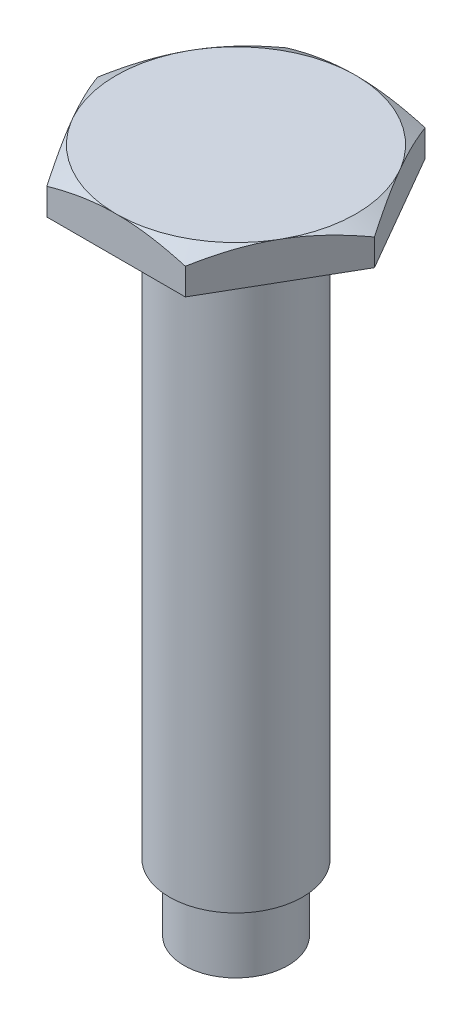
ISO-10303-21;
HEADER;
FILE_DESCRIPTION(('STEP AP214'),'2;1');
FILE_NAME('part.step','',(''),(''),'','','');
FILE_SCHEMA(('AUTOMOTIVE_DESIGN { 1 0 10303 214 1 1 1 1 }'));
ENDSEC;
DATA;
#1=APPLICATION_CONTEXT('core data for automotive mechanical design processes');
#2=APPLICATION_PROTOCOL_DEFINITION('international standard','automotive_design',2000,#1);
#3=PRODUCT_CONTEXT('',#1,'mechanical');
#4=PRODUCT('Part','Part','',(#3));
#5=PRODUCT_RELATED_PRODUCT_CATEGORY('part','',(#4));
#6=PRODUCT_DEFINITION_FORMATION('','',#4);
#7=PRODUCT_DEFINITION_CONTEXT('part definition',#1,'design');
#8=PRODUCT_DEFINITION('design','',#6,#7);
#9=PRODUCT_DEFINITION_SHAPE('','',#8);
#10=(LENGTH_UNIT() NAMED_UNIT(*) SI_UNIT(.MILLI.,.METRE.));
#11=(NAMED_UNIT(*) PLANE_ANGLE_UNIT() SI_UNIT($,.RADIAN.));
#12=(NAMED_UNIT(*) SI_UNIT($,.STERADIAN.) SOLID_ANGLE_UNIT());
#13=UNCERTAINTY_MEASURE_WITH_UNIT(LENGTH_MEASURE(1.E-05),#10,'distance_accuracy_value','');
#14=(GEOMETRIC_REPRESENTATION_CONTEXT(3) GLOBAL_UNCERTAINTY_ASSIGNED_CONTEXT((#13)) GLOBAL_UNIT_ASSIGNED_CONTEXT((#10,
#11,#12)) REPRESENTATION_CONTEXT('',''));
#15=CARTESIAN_POINT('',(0.,0.,0.));
#16=DIRECTION('',(0.,0.,1.));
#17=DIRECTION('',(1.,0.,0.));
#18=AXIS2_PLACEMENT_3D('',#15,#16,#17);
#19=CARTESIAN_POINT('',(0.,-24.3,0.));
#20=DIRECTION('',(0.,1.,0.));
#21=DIRECTION('',(0.,0.,1.));
#22=AXIS2_PLACEMENT_3D('',#19,#20,#21);
#23=CYLINDRICAL_SURFACE('',#22,2.5);
#24=CARTESIAN_POINT('',(0.,0.,0.));
#25=DIRECTION('',(0.,1.,0.));
#26=DIRECTION('',(0.,0.,1.));
#27=AXIS2_PLACEMENT_3D('',#24,#25,#26);
#28=CIRCLE('',#27,2.5);
#29=CARTESIAN_POINT('',(0.,0.,2.5));
#30=VERTEX_POINT('',#29);
#31=EDGE_CURVE('E13',#30,#30,#28,.F.);
#32=ORIENTED_EDGE('',*,*,#31,.T.);
#33=EDGE_LOOP('',(#32));
#34=FACE_BOUND('',#33,.T.);
#35=CARTESIAN_POINT('',(0.,-21.8,0.));
#36=DIRECTION('',(0.,-1.,0.));
#37=DIRECTION('',(0.,0.,-1.));
#38=AXIS2_PLACEMENT_3D('',#35,#36,#37);
#39=CIRCLE('',#38,2.5);
#40=CARTESIAN_POINT('',(0.,-21.8,-2.5));
#41=VERTEX_POINT('',#40);
#42=EDGE_CURVE('E60',#41,#41,#39,.T.);
#43=ORIENTED_EDGE('',*,*,#42,.F.);
#44=EDGE_LOOP('',(#43));
#45=FACE_BOUND('',#44,.T.);
#46=ADVANCED_FACE('F55',(#34,#45),#23,.T.);
#47=CARTESIAN_POINT('',(2.5975,1.4,4.49900197266016));
#48=DIRECTION('',(-0.866025403784439,0.,-0.5));
#49=DIRECTION('',(-0.5,0.,0.866025403784439));
#50=AXIS2_PLACEMENT_3D('',#47,#48,#49);
#51=PLANE('',#50);
#52=CARTESIAN_POINT('',(0.764746267767835,-0.454124789273067,7.67342455464776));
#53=CARTESIAN_POINT('',(0.846540705660757,-0.377433019190196,7.53175243244068));
#54=CARTESIAN_POINT('',(0.928528072742444,-0.301551957905063,7.3897461470764));
#55=CARTESIAN_POINT('',(1.09297003020882,-0.151791197053435,7.10492432184856));
#56=CARTESIAN_POINT('',(1.17542467594591,-0.0779117408474091,6.96210868611182));
#57=CARTESIAN_POINT('',(1.34112030157134,0.0676733695980131,6.67511544393666));
#58=CARTESIAN_POINT('',(1.42436293029547,0.139371540587462,6.53093498163088));
#59=CARTESIAN_POINT('',(1.59146398387532,0.279831230371151,6.24150746683229));
#60=CARTESIAN_POINT('',(1.67532238968743,0.348592839537418,6.09626044732398));
#61=CARTESIAN_POINT('',(1.84599265044855,0.484316646401144,5.80065088434469));
#62=CARTESIAN_POINT('',(1.93282376130974,0.551182431909523,5.65025498865547));
#63=CARTESIAN_POINT('',(2.10734549477341,0.680257160061498,5.3479744792714));
#64=CARTESIAN_POINT('',(2.19503606852409,0.742466365668551,5.19608995019036));
#65=CARTESIAN_POINT('',(2.37131571795982,0.861080845971694,4.89076464102724));
#66=CARTESIAN_POINT('',(2.45990392715668,0.917491222644587,4.73732536174674));
#67=CARTESIAN_POINT('',(2.63812027232068,1.02322633098802,4.42864559718346));
#68=CARTESIAN_POINT('',(2.72774827495578,1.07255196051071,4.27340534283854));
#69=CARTESIAN_POINT('',(2.94167693195855,1.17932065353719,3.90287003971477));
#70=CARTESIAN_POINT('',(3.06647240761128,1.23295723560288,3.68671793532951));
#71=CARTESIAN_POINT('',(3.25497393542946,1.29798014863304,3.36022371184407));
#72=CARTESIAN_POINT('',(3.31802487416995,1.31708228871089,3.25101628248064));
#73=CARTESIAN_POINT('',(3.44448603325496,1.34966788109555,3.03197912976134));
#74=CARTESIAN_POINT('',(3.50789620500962,1.36315207572337,2.92214949056561));
#75=CARTESIAN_POINT('',(3.63421230786921,1.3839969781063,2.7033635825987));
#76=CARTESIAN_POINT('',(3.69711530695999,1.39142837342597,2.59441239222501));
#77=CARTESIAN_POINT('',(3.82302741588169,1.40021353929659,2.37632622228448));
#78=CARTESIAN_POINT('',(3.88603652392881,1.40156741101706,2.26719124580728));
#79=CARTESIAN_POINT('',(4.01201417247894,1.39815550680156,2.04899155790038));
#80=CARTESIAN_POINT('',(4.07498271233779,1.39338963597678,1.93992684758643));
#81=CARTESIAN_POINT('',(4.20073678228329,1.37788386249752,1.72211440918226));
#82=CARTESIAN_POINT('',(4.26352230002154,1.36714356571949,1.6133667024801));
#83=CARTESIAN_POINT('',(4.41065120501361,1.33525044365775,1.35853196377184));
#84=CARTESIAN_POINT('',(4.49486953949365,1.31177164019821,1.2126615295236));
#85=CARTESIAN_POINT('',(4.66253101838631,1.25557216182377,0.922263329609364));
#86=CARTESIAN_POINT('',(4.74597403931673,1.22285003995282,0.777735777820844));
#87=CARTESIAN_POINT('',(4.91205251429679,1.14940005301191,0.490079421111826));
#88=CARTESIAN_POINT('',(4.99468708095955,1.10866424445279,0.346952153190496));
#89=CARTESIAN_POINT('',(5.15904334370627,1.02046987040766,0.0622787555710296));
#90=CARTESIAN_POINT('',(5.24076506447544,0.973011487190809,-0.0792674168831269));
#91=CARTESIAN_POINT('',(5.40431916872383,0.871907470927307,-0.362551435227752));
#92=CARTESIAN_POINT('',(5.48614102218207,0.818194179899497,-0.504271042586887));
#93=CARTESIAN_POINT('',(5.64897798391222,0.706057896456655,-0.786312933653649));
#94=CARTESIAN_POINT('',(5.72999301279723,0.647634445633892,-0.926635079859158));
#95=CARTESIAN_POINT('',(5.89125020454739,0.526954778850263,-1.2059407290563));
#96=CARTESIAN_POINT('',(5.97149278220745,0.464700769888742,-1.34492495049381));
#97=CARTESIAN_POINT('',(6.13134236600289,0.337008626902665,-1.62179255119626));
#98=CARTESIAN_POINT('',(6.21094935554493,0.271570410062166,-1.75967590172068));
#99=CARTESIAN_POINT('',(6.35269983057958,0.152286187773574,-2.00519492647773));
#100=CARTESIAN_POINT('',(6.41494928140599,0.0989419583375809,-2.11301413805233));
#101=CARTESIAN_POINT('',(6.53913777871832,-0.00915825365950849,-2.32811492511291));
#102=CARTESIAN_POINT('',(6.60107683757794,-0.063914179400276,-2.43539652203077));
#103=CARTESIAN_POINT('',(6.72394062975798,-0.173990162223894,-2.64820285249718));
#104=CARTESIAN_POINT('',(6.78486863438338,-0.229295639253393,-2.75373325211216));
#105=CARTESIAN_POINT('',(6.90648459300393,-0.340958275081431,-2.96437827145415));
#106=CARTESIAN_POINT('',(6.96717254297768,-0.397315451408354,-3.06949288421589));
#107=CARTESIAN_POINT('',(7.02775373223217,-0.454124789273058,-3.1744225819876));
#108=B_SPLINE_CURVE_WITH_KNOTS('',3,(#52,#53,#54,#55,#56,#57,#58,#59,#60,#61,#62,#63,#64,#65,
#66,#67,#68,#69,#70,#71,#72,#73,#74,#75,#76,#77,#78,#79,#80,#81,#82,#83,#84,#85,#86,#87,#88,#89,
#90,#91,#92,#93,#94,#95,#96,#97,#98,#99,#100,#101,#102,#103,#104,#105,#106,#107),.UNSPECIFIED.,
.F.,.F.,(4,2,2,2,2,2,2,2,2,2,2,2,2,2,2,2,2,2,2,2,2,2,2,2,2,2,2,4),(0.,0.542026372178204,
1.08411835228508,1.62789791735099,2.17166073564649,2.72987716868045,3.28806205464704,
3.84575155274402,4.40337031220445,5.16842888782534,5.550946692113,5.9334139367919,
6.31134777627519,6.68927532445917,7.06720873261637,7.44516707540755,7.95505681600911,
8.46502641941073,8.97550409574346,9.48596793414437,10.0025821226153,10.5192466504577,
11.0356162367859,11.5519992602125,11.9583277083475,12.3646398273455,12.7660923087187,
13.1675514869771),.UNSPECIFIED.);
#109=CARTESIAN_POINT('',(2.5975,0.998741562913211,4.49900197266016));
#110=VERTEX_POINT('',#109);
#111=CARTESIAN_POINT('',(3.84886527144745,1.4,2.33157374368596));
#112=VERTEX_POINT('',#111);
#113=EDGE_CURVE('E151',#110,#112,#108,.T.);
#114=ORIENTED_EDGE('',*,*,#113,.F.);
#115=DIRECTION('',(0.,-1.,0.));
#116=VECTOR('',#115,1.);
#117=CARTESIAN_POINT('',(2.5975,1.4,4.49900197266016));
#118=LINE('',#117,#116);
#119=CARTESIAN_POINT('',(2.5975,0.,4.49900197266016));
#120=VERTEX_POINT('',#119);
#121=EDGE_CURVE('E164',#110,#120,#118,.T.);
#122=ORIENTED_EDGE('',*,*,#121,.T.);
#123=DIRECTION('',(0.5,0.,-0.866025403784439));
#124=VECTOR('',#123,1.);
#125=CARTESIAN_POINT('',(2.5975,0.,4.49900197266016));
#126=LINE('',#125,#124);
#127=CARTESIAN_POINT('',(5.195,0.,0.));
#128=VERTEX_POINT('',#127);
#129=EDGE_CURVE('E183',#120,#128,#126,.T.);
#130=ORIENTED_EDGE('',*,*,#129,.T.);
#131=DIRECTION('',(0.,-1.,0.));
#132=VECTOR('',#131,1.);
#133=CARTESIAN_POINT('',(5.195,1.4,0.));
#134=LINE('',#133,#132);
#135=CARTESIAN_POINT('',(5.19500000000003,0.998741562913259,0.));
#136=VERTEX_POINT('',#135);
#137=EDGE_CURVE('E218',#136,#128,#134,.T.);
#138=ORIENTED_EDGE('',*,*,#137,.F.);
#139=CARTESIAN_POINT('',(3.94363472855255,1.4,2.1674282289742));
#140=VERTEX_POINT('',#139);
#141=EDGE_CURVE('E188',#140,#136,#108,.T.);
#142=ORIENTED_EDGE('',*,*,#141,.F.);
#143=DIRECTION('',(0.5,0.,-0.866025403784439));
#144=VECTOR('',#143,1.);
#145=CARTESIAN_POINT('',(2.5975,1.4,4.49900197266016));
#146=LINE('',#145,#144);
#147=EDGE_CURVE('E205',#112,#140,#146,.T.);
#148=ORIENTED_EDGE('',*,*,#147,.F.);
#149=EDGE_LOOP('',(#114,#122,#130,#138,#142,#148));
#150=FACE_BOUND('',#149,.T.);
#151=ADVANCED_FACE('F57',(#150),#51,.F.);
#152=CARTESIAN_POINT('',(5.195,1.4,0.));
#153=DIRECTION('',(-0.866025403784439,0.,0.5));
#154=DIRECTION('',(0.5,0.,0.866025403784439));
#155=AXIS2_PLACEMENT_3D('',#152,#153,#154);
#156=PLANE('',#155);
#157=CARTESIAN_POINT('',(7.02775373223216,-0.454124789273065,3.17442258198759));
#158=CARTESIAN_POINT('',(6.94595929433924,-0.377433019190193,3.03275045978052));
#159=CARTESIAN_POINT('',(6.86397192725755,-0.30155195790506,2.89074417441623));
#160=CARTESIAN_POINT('',(6.69952996979118,-0.151791197053433,2.6059223491884));
#161=CARTESIAN_POINT('',(6.61707532405409,-0.077911740847407,2.46310671345166));
#162=CARTESIAN_POINT('',(6.45137969842866,0.0676733695980147,2.1761134712765));
#163=CARTESIAN_POINT('',(6.36813706970453,0.139371540587463,2.03193300897072));
#164=CARTESIAN_POINT('',(6.20103601612468,0.279831230371152,1.74250549417213));
#165=CARTESIAN_POINT('',(6.11717761031257,0.34859283953742,1.59725847466382));
#166=CARTESIAN_POINT('',(5.94650734955145,0.484316646401146,1.30164891168453));
#167=CARTESIAN_POINT('',(5.85967623869026,0.551182431909525,1.15125301599531));
#168=CARTESIAN_POINT('',(5.68515450522659,0.680257160061499,0.848972506611236));
#169=CARTESIAN_POINT('',(5.59746393147591,0.742466365668553,0.697087977530198));
#170=CARTESIAN_POINT('',(5.42118428204018,0.861080845971696,0.391762668367075));
#171=CARTESIAN_POINT('',(5.33259607284332,0.917491222644589,0.238323389086572));
#172=CARTESIAN_POINT('',(5.15437972767932,1.02322633098802,-0.0703563754767021));
#173=CARTESIAN_POINT('',(5.06475172504421,1.07255196051071,-0.225596629821623));
#174=CARTESIAN_POINT('',(4.85082306804145,1.17932065353719,-0.596131932945389));
#175=CARTESIAN_POINT('',(4.72602759238872,1.23295723560288,-0.812284037330647));
#176=CARTESIAN_POINT('',(4.53752606457053,1.29798014863304,-1.1387782608161));
#177=CARTESIAN_POINT('',(4.47447512583005,1.31708228871089,-1.24798569017953));
#178=CARTESIAN_POINT('',(4.34801396674504,1.34966788109555,-1.46702284289882));
#179=CARTESIAN_POINT('',(4.28460379499038,1.36315207572337,-1.57685248209455));
#180=CARTESIAN_POINT('',(4.15828769213079,1.3839969781063,-1.79563839006147));
#181=CARTESIAN_POINT('',(4.09538469304001,1.39142837342597,-1.90458958043515));
#182=CARTESIAN_POINT('',(3.96947258411831,1.40021353929659,-2.12267575037568));
#183=CARTESIAN_POINT('',(3.90646347607119,1.40156741101706,-2.23181072685288));
#184=CARTESIAN_POINT('',(3.78048582752106,1.39815550680156,-2.45001041475978));
#185=CARTESIAN_POINT('',(3.71751728766221,1.39338963597678,-2.55907512507373));
#186=CARTESIAN_POINT('',(3.59176321771671,1.37788386249752,-2.7768875634779));
#187=CARTESIAN_POINT('',(3.52897769997846,1.36714356571949,-2.88563527018006));
#188=CARTESIAN_POINT('',(3.38184879498638,1.33525044365775,-3.14047000888832));
#189=CARTESIAN_POINT('',(3.29763046050635,1.31177164019821,-3.28634044313656));
#190=CARTESIAN_POINT('',(3.12996898161369,1.25557216182377,-3.57673864305079));
#191=CARTESIAN_POINT('',(3.04652596068327,1.22285003995282,-3.72126619483932));
#192=CARTESIAN_POINT('',(2.88044748570321,1.14940005301191,-4.00892255154833));
#193=CARTESIAN_POINT('',(2.79781291904045,1.10866424445279,-4.15204981946966));
#194=CARTESIAN_POINT('',(2.63345665629373,1.02046987040766,-4.43672321708913));
#195=CARTESIAN_POINT('',(2.55173493552456,0.973011487190809,-4.57826938954329));
#196=CARTESIAN_POINT('',(2.38818083127617,0.871907470927306,-4.86155340788791));
#197=CARTESIAN_POINT('',(2.30635897781793,0.818194179899496,-5.00327301524705));
#198=CARTESIAN_POINT('',(2.14352201608778,0.706057896456654,-5.28531490631381));
#199=CARTESIAN_POINT('',(2.06250698720276,0.647634445633891,-5.42563705251932));
#200=CARTESIAN_POINT('',(1.90124979545261,0.526954778850262,-5.70494270171646));
#201=CARTESIAN_POINT('',(1.82100721779255,0.46470076988874,-5.84392692315397));
#202=CARTESIAN_POINT('',(1.66115763399711,0.337008626902662,-6.12079452385642));
#203=CARTESIAN_POINT('',(1.58155064445506,0.271570410062163,-6.25867787438085));
#204=CARTESIAN_POINT('',(1.43980016942041,0.152286187773572,-6.50419689913789));
#205=CARTESIAN_POINT('',(1.377550718594,0.098941958337579,-6.61201611071249));
#206=CARTESIAN_POINT('',(1.25336222128168,-0.00915825365951011,-6.82711689777307));
#207=CARTESIAN_POINT('',(1.19142316242206,-0.0639141794002777,-6.93439849469092));
#208=CARTESIAN_POINT('',(1.06855937024202,-0.173990162223895,-7.14720482515734));
#209=CARTESIAN_POINT('',(1.00763136561662,-0.229295639253394,-7.25273522477232));
#210=CARTESIAN_POINT('',(0.886015406996071,-0.340958275081432,-7.46338024411431));
#211=CARTESIAN_POINT('',(0.825327457022315,-0.397315451408355,-7.56849485687605));
#212=CARTESIAN_POINT('',(0.764746267767833,-0.454124789273058,-7.67342455464776));
#213=B_SPLINE_CURVE_WITH_KNOTS('',3,(#157,#158,#159,#160,#161,#162,#163,#164,#165,#166,#167,
#168,#169,#170,#171,#172,#173,#174,#175,#176,#177,#178,#179,#180,#181,#182,#183,#184,#185,#186,
#187,#188,#189,#190,#191,#192,#193,#194,#195,#196,#197,#198,#199,#200,#201,#202,#203,#204,#205,
#206,#207,#208,#209,#210,#211,#212),.UNSPECIFIED.,.F.,.F.,(4,2,2,2,2,2,2,2,2,2,2,2,2,2,2,2,2,2,
2,2,2,2,2,2,2,2,2,4),(0.,0.542026372178205,1.08411835228508,1.62789791735099,2.17166073564649,
2.72987716868045,3.28806205464704,3.84575155274402,4.40337031220445,5.16842888782534,
5.550946692113,5.9334139367919,6.31134777627518,6.68927532445916,7.06720873261636,
7.44516707540755,7.9550568160091,8.46502641941072,8.97550409574346,9.48596793414437,
10.0025821226153,10.5192466504577,11.0356162367859,11.5519992602125,11.9583277083475,
12.3646398273455,12.7660923087187,13.1675514869771),.UNSPECIFIED.);
#214=CARTESIAN_POINT('',(3.94363472855255,1.4,-2.1674282289742));
#215=VERTEX_POINT('',#214);
#216=EDGE_CURVE('E267',#136,#215,#213,.T.);
#217=ORIENTED_EDGE('',*,*,#216,.F.);
#218=ORIENTED_EDGE('',*,*,#137,.T.);
#219=DIRECTION('',(-0.5,0.,-0.866025403784439));
#220=VECTOR('',#219,1.);
#221=CARTESIAN_POINT('',(5.195,0.,0.));
#222=LINE('',#221,#220);
#223=CARTESIAN_POINT('',(2.5975,0.,-4.49900197266016));
#224=VERTEX_POINT('',#223);
#225=EDGE_CURVE('E187',#128,#224,#222,.T.);
#226=ORIENTED_EDGE('',*,*,#225,.T.);
#227=DIRECTION('',(0.,-1.,0.));
#228=VECTOR('',#227,1.);
#229=CARTESIAN_POINT('',(2.5975,1.4,-4.49900197266016));
#230=LINE('',#229,#228);
#231=CARTESIAN_POINT('',(2.5975,0.998741562913212,-4.49900197266016));
#232=VERTEX_POINT('',#231);
#233=EDGE_CURVE('E215',#232,#224,#230,.T.);
#234=ORIENTED_EDGE('',*,*,#233,.F.);
#235=CARTESIAN_POINT('',(3.84886527144745,1.4,-2.33157374368596));
#236=VERTEX_POINT('',#235);
#237=EDGE_CURVE('E261',#236,#232,#213,.T.);
#238=ORIENTED_EDGE('',*,*,#237,.F.);
#239=DIRECTION('',(-0.5,0.,-0.866025403784439));
#240=VECTOR('',#239,1.);
#241=CARTESIAN_POINT('',(5.195,1.4,0.));
#242=LINE('',#241,#240);
#243=EDGE_CURVE('E254',#215,#236,#242,.T.);
#244=ORIENTED_EDGE('',*,*,#243,.F.);
#245=EDGE_LOOP('',(#217,#218,#226,#234,#238,#244));
#246=FACE_BOUND('',#245,.T.);
#247=ADVANCED_FACE('F275',(#246),#156,.F.);
#248=CARTESIAN_POINT('',(2.5975,1.4,-4.49900197266016));
#249=DIRECTION('',(0.,0.,1.));
#250=DIRECTION('',(1.,0.,0.));
#251=AXIS2_PLACEMENT_3D('',#248,#249,#250);
#252=PLANE('',#251);
#253=CARTESIAN_POINT('',(5.77192258198759,-0.227090808716546,-4.49900197266016));
#254=CARTESIAN_POINT('',(5.60913755966845,-0.152984369439807,-4.49900197266016));
#255=CARTESIAN_POINT('',(5.44591300460618,-0.0798254228658757,-4.49900197266016));
#256=CARTESIAN_POINT('',(5.11839636806293,0.0641385338696213,-4.49900197266016));
#257=CARTESIAN_POINT('',(4.9541041050891,0.134943130618416,-4.49900197266016));
#258=CARTESIAN_POINT('',(4.62365019074874,0.273995214668935,-4.49900197266016));
#259=CARTESIAN_POINT('',(4.45748365552962,0.342231139729387,-4.49900197266016));
#260=CARTESIAN_POINT('',(4.12376096204262,0.475206584033677,-4.49900197266016));
#261=CARTESIAN_POINT('',(3.95620486637187,0.539946259800704,-4.49900197266016));
#262=CARTESIAN_POINT('',(3.62014094058057,0.664910495326106,-4.49900197266016));
#263=CARTESIAN_POINT('',(3.45163923170269,0.725151431085589,-4.49900197266016));
#264=CARTESIAN_POINT('',(3.11284465445949,0.840435342818388,-4.49900197266016));
#265=CARTESIAN_POINT('',(2.94255166995606,0.895477979420265,-4.49900197266016));
#266=CARTESIAN_POINT('',(2.60024415659692,0.999126538813837,-4.49900197266016));
#267=CARTESIAN_POINT('',(2.42823222054523,1.04774093062003,-4.49900197266016));
#268=CARTESIAN_POINT('',(2.08222141630835,1.1372651045468,-4.49900197266016));
#269=CARTESIAN_POINT('',(1.90822263490411,1.17817522181794,-4.49900197266016));
#270=CARTESIAN_POINT('',(1.48338106639456,1.26633205480424,-4.49900197266016));
#271=CARTESIAN_POINT('',(1.23149635233239,1.30880729595718,-4.49900197266016));
#272=CARTESIAN_POINT('',(0.851636268195707,1.35541796650651,-4.49900197266016));
#273=CARTESIAN_POINT('',(0.724677188925095,1.3681044984636,-4.49900197266016));
#274=CARTESIAN_POINT('',(0.470303771867612,1.38743553984244,-4.49900197266016));
#275=CARTESIAN_POINT('',(0.342889490864874,1.39408077816295,-4.49900197266016));
#276=CARTESIAN_POINT('',(0.0879655096792876,1.40111945511139,-4.49900197266016));
#277=CARTESIAN_POINT('',(-0.0395440862933155,1.40151666976282,-4.49900197266016));
#278=CARTESIAN_POINT('',(-0.294427215994776,1.39605864535107,-4.49900197266016));
#279=CARTESIAN_POINT('',(-0.421800750546122,1.39020344430019,-4.49900197266016));
#280=CARTESIAN_POINT('',(-0.67612009637022,1.37241909335192,-4.49900197266016));
#281=CARTESIAN_POINT('',(-0.803065911348346,1.36048999621015,-4.49900197266016));
#282=CARTESIAN_POINT('',(-1.05629749340669,1.33090647036077,-4.49900197266016));
#283=CARTESIAN_POINT('',(-1.18258313686381,1.3132510057949,-4.49900197266016));
#284=CARTESIAN_POINT('',(-1.69482776062332,1.23064719090392,-4.49900197266016));
#285=CARTESIAN_POINT('',(-2.07730821187047,1.14344279907834,-4.49900197266016));
#286=CARTESIAN_POINT('',(-2.64380905996445,0.986818585267799,-4.49900197266016));
#287=CARTESIAN_POINT('',(-2.83170917259291,0.930205673031296,-4.49900197266016));
#288=CARTESIAN_POINT('',(-3.20529209927546,0.810030633732534,-4.49900197266016));
#289=CARTESIAN_POINT('',(-3.39097508137221,0.746469037087198,-4.49900197266016));
#290=CARTESIAN_POINT('',(-3.76270287607295,0.612937713374495,-4.49900197266016));
#291=CARTESIAN_POINT('',(-3.94872142031268,0.542895859459579,-4.49900197266016));
#292=CARTESIAN_POINT('',(-4.3189879420537,0.398256135634828,-4.49900197266016));
#293=CARTESIAN_POINT('',(-4.50323580111474,0.323657963376374,-4.49900197266016));
#294=CARTESIAN_POINT('',(-4.86897004788675,0.171331942110032,-4.49900197266016));
#295=CARTESIAN_POINT('',(-5.05046667596422,0.0936285461315302,-4.49900197266016));
#296=CARTESIAN_POINT('',(-5.41212709767287,-0.064699465637042,-4.49900197266016));
#297=CARTESIAN_POINT('',(-5.59229122543423,-0.145323316986271,-4.49900197266016));
#298=CARTESIAN_POINT('',(-5.7719225819876,-0.227090808716548,-4.49900197266016));
#299=B_SPLINE_CURVE_WITH_KNOTS('',3,(#253,#254,#255,#256,#257,#258,#259,#260,#261,#262,#263,
#264,#265,#266,#267,#268,#269,#270,#271,#272,#273,#274,#275,#276,#277,#278,#279,#280,#281,#282,
#283,#284,#285,#286,#287,#288,#289,#290,#291,#292,#293,#294,#295,#296,#297,#298),.UNSPECIFIED.,
.F.,.F.,(4,2,2,2,2,2,2,2,2,2,2,2,2,2,2,2,2,2,2,2,2,2,4),(0.,0.536586650514957,1.07326703082519,
1.61212860577172,2.15096603645265,2.68773532632305,3.2245396350365,3.76062952038355,
4.29669607941342,5.06200202870462,5.44465629336931,5.827264383611,6.20964123390159,
6.59201575950021,6.97438696399191,7.35682737526941,8.53074642990351,9.11943237505045,
9.70807341511456,10.3043127706032,10.9005917344777,11.4928560768004,12.0849664961993),.UNSPECIFIED.);
#300=CARTESIAN_POINT('',(0.0947694571050346,1.4,-4.49900197266016));
#301=VERTEX_POINT('',#300);
#302=EDGE_CURVE('E268',#232,#301,#299,.T.);
#303=ORIENTED_EDGE('',*,*,#302,.F.);
#304=ORIENTED_EDGE('',*,*,#233,.T.);
#305=DIRECTION('',(-1.,0.,0.));
#306=VECTOR('',#305,1.);
#307=CARTESIAN_POINT('',(2.5975,0.,-4.49900197266016));
#308=LINE('',#307,#306);
#309=CARTESIAN_POINT('',(-2.5975,0.,-4.49900197266016));
#310=VERTEX_POINT('',#309);
#311=EDGE_CURVE('E192',#224,#310,#308,.T.);
#312=ORIENTED_EDGE('',*,*,#311,.T.);
#313=DIRECTION('',(0.,-1.,0.));
#314=VECTOR('',#313,1.);
#315=CARTESIAN_POINT('',(-2.5975,1.4,-4.49900197266016));
#316=LINE('',#315,#314);
#317=CARTESIAN_POINT('',(-2.59749999999996,0.998741562913258,-4.49900197266022));
#318=VERTEX_POINT('',#317);
#319=EDGE_CURVE('E212',#318,#310,#316,.T.);
#320=ORIENTED_EDGE('',*,*,#319,.F.);
#321=CARTESIAN_POINT('',(-0.0947694571050331,1.4,-4.49900197266016));
#322=VERTEX_POINT('',#321);
#323=EDGE_CURVE('E269',#322,#318,#299,.T.);
#324=ORIENTED_EDGE('',*,*,#323,.F.);
#325=DIRECTION('',(-1.,0.,0.));
#326=VECTOR('',#325,1.);
#327=CARTESIAN_POINT('',(2.5975,1.4,-4.49900197266016));
#328=LINE('',#327,#326);
#329=EDGE_CURVE('E241',#301,#322,#328,.T.);
#330=ORIENTED_EDGE('',*,*,#329,.F.);
#331=EDGE_LOOP('',(#303,#304,#312,#320,#324,#330));
#332=FACE_BOUND('',#331,.T.);
#333=ADVANCED_FACE('F313',(#332),#252,.F.);
#334=CARTESIAN_POINT('',(-2.5975,1.4,-4.49900197266016));
#335=DIRECTION('',(0.866025403784439,0.,0.5));
#336=DIRECTION('',(0.5,0.,-0.866025403784439));
#337=AXIS2_PLACEMENT_3D('',#334,#335,#336);
#338=PLANE('',#337);
#339=CARTESIAN_POINT('',(-0.764746267767833,-0.454124789273067,-7.67342455464776));
#340=CARTESIAN_POINT('',(-0.846540705660756,-0.377433019190196,-7.53175243244068));
#341=CARTESIAN_POINT('',(-0.928528072742443,-0.301551957905063,-7.3897461470764));
#342=CARTESIAN_POINT('',(-1.09297003020882,-0.151791197053435,-7.10492432184856));
#343=CARTESIAN_POINT('',(-1.17542467594591,-0.0779117408474092,-6.96210868611182));
#344=CARTESIAN_POINT('',(-1.34112030157134,0.0676733695980126,-6.67511544393666));
#345=CARTESIAN_POINT('',(-1.42436293029547,0.139371540587461,-6.53093498163088));
#346=CARTESIAN_POINT('',(-1.59146398387532,0.27983123037115,-6.24150746683229));
#347=CARTESIAN_POINT('',(-1.67532238968743,0.348592839537418,-6.09626044732398));
#348=CARTESIAN_POINT('',(-1.84599265044855,0.484316646401144,-5.80065088434469));
#349=CARTESIAN_POINT('',(-1.93282376130974,0.551182431909523,-5.65025498865547));
#350=CARTESIAN_POINT('',(-2.10734549477341,0.680257160061497,-5.3479744792714));
#351=CARTESIAN_POINT('',(-2.19503606852409,0.742466365668551,-5.19608995019036));
#352=CARTESIAN_POINT('',(-2.37131571795982,0.861080845971694,-4.89076464102724));
#353=CARTESIAN_POINT('',(-2.45990392715668,0.917491222644587,-4.73732536174674));
#354=CARTESIAN_POINT('',(-2.63812027232068,1.02322633098802,-4.42864559718346));
#355=CARTESIAN_POINT('',(-2.72774827495578,1.07255196051071,-4.27340534283854));
#356=CARTESIAN_POINT('',(-2.94167693195855,1.17932065353718,-3.90287003971478));
#357=CARTESIAN_POINT('',(-3.06647240761128,1.23295723560288,-3.68671793532952));
#358=CARTESIAN_POINT('',(-3.25497393542946,1.29798014863304,-3.36022371184407));
#359=CARTESIAN_POINT('',(-3.31802487416995,1.31708228871089,-3.25101628248064));
#360=CARTESIAN_POINT('',(-3.44448603325496,1.34966788109555,-3.03197912976134));
#361=CARTESIAN_POINT('',(-3.50789620500962,1.36315207572337,-2.92214949056561));
#362=CARTESIAN_POINT('',(-3.63421230786921,1.3839969781063,-2.7033635825987));
#363=CARTESIAN_POINT('',(-3.69711530695999,1.39142837342596,-2.59441239222502));
#364=CARTESIAN_POINT('',(-3.82302741588169,1.40021353929659,-2.37632622228448));
#365=CARTESIAN_POINT('',(-3.8860365239288,1.40156741101706,-2.26719124580728));
#366=CARTESIAN_POINT('',(-4.01201417247894,1.39815550680156,-2.04899155790039));
#367=CARTESIAN_POINT('',(-4.07498271233779,1.39338963597678,-1.93992684758643));
#368=CARTESIAN_POINT('',(-4.20073678228329,1.37788386249752,-1.72211440918227));
#369=CARTESIAN_POINT('',(-4.26352230002154,1.36714356571949,-1.6133667024801));
#370=CARTESIAN_POINT('',(-4.41065120501361,1.33525044365775,-1.35853196377185));
#371=CARTESIAN_POINT('',(-4.49486953949365,1.31177164019821,-1.2126615295236));
#372=CARTESIAN_POINT('',(-4.66253101838631,1.25557216182377,-0.922263329609371));
#373=CARTESIAN_POINT('',(-4.74597403931673,1.22285003995282,-0.77773577782085));
#374=CARTESIAN_POINT('',(-4.91205251429679,1.14940005301191,-0.490079421111832));
#375=CARTESIAN_POINT('',(-4.99468708095954,1.10866424445279,-0.346952153190502));
#376=CARTESIAN_POINT('',(-5.15904334370627,1.02046987040766,-0.062278755571036));
#377=CARTESIAN_POINT('',(-5.24076506447544,0.97301148719081,0.0792674168831205));
#378=CARTESIAN_POINT('',(-5.40431916872383,0.871907470927308,0.362551435227746));
#379=CARTESIAN_POINT('',(-5.48614102218207,0.818194179899498,0.50427104258688));
#380=CARTESIAN_POINT('',(-5.64897798391222,0.706057896456656,0.786312933653643));
#381=CARTESIAN_POINT('',(-5.72999301279723,0.647634445633894,0.926635079859152));
#382=CARTESIAN_POINT('',(-5.89125020454739,0.526954778850265,1.20594072905629));
#383=CARTESIAN_POINT('',(-5.97149278220745,0.464700769888743,1.34492495049381));
#384=CARTESIAN_POINT('',(-6.13134236600289,0.337008626902666,1.62179255119625));
#385=CARTESIAN_POINT('',(-6.21094935554493,0.271570410062167,1.75967590172068));
#386=CARTESIAN_POINT('',(-6.35269983057958,0.152286187773576,2.00519492647772));
#387=CARTESIAN_POINT('',(-6.41494928140599,0.0989419583375829,2.11301413805232));
#388=CARTESIAN_POINT('',(-6.53913777871832,-0.00915825365950742,2.3281149251129));
#389=CARTESIAN_POINT('',(-6.60107683757794,-0.0639141794002759,2.43539652203076));
#390=CARTESIAN_POINT('',(-6.72394062975798,-0.173990162223894,2.64820285249718));
#391=CARTESIAN_POINT('',(-6.78486863438338,-0.229295639253393,2.75373325211216));
#392=CARTESIAN_POINT('',(-6.90648459300393,-0.340958275081431,2.96437827145414));
#393=CARTESIAN_POINT('',(-6.96717254297768,-0.397315451408355,3.06949288421589));
#394=CARTESIAN_POINT('',(-7.02775373223217,-0.454124789273059,3.1744225819876));
#395=B_SPLINE_CURVE_WITH_KNOTS('',3,(#339,#340,#341,#342,#343,#344,#345,#346,#347,#348,#349,
#350,#351,#352,#353,#354,#355,#356,#357,#358,#359,#360,#361,#362,#363,#364,#365,#366,#367,#368,
#369,#370,#371,#372,#373,#374,#375,#376,#377,#378,#379,#380,#381,#382,#383,#384,#385,#386,#387,
#388,#389,#390,#391,#392,#393,#394),.UNSPECIFIED.,.F.,.F.,(4,2,2,2,2,2,2,2,2,2,2,2,2,2,2,2,2,2,
2,2,2,2,2,2,2,2,2,4),(0.,0.542026372178204,1.08411835228508,1.62789791735099,2.17166073564649,
2.72987716868045,3.28806205464704,3.84575155274402,4.40337031220445,5.16842888782534,
5.550946692113,5.9334139367919,6.31134777627518,6.68927532445916,7.06720873261636,
7.44516707540755,7.9550568160091,8.46502641941072,8.97550409574346,9.48596793414436,
10.0025821226153,10.5192466504577,11.0356162367859,11.5519992602125,11.9583277083475,
12.3646398273455,12.7660923087187,13.1675514869771),.UNSPECIFIED.);
#396=CARTESIAN_POINT('',(-3.84886527144748,1.4,-2.3315737436859));
#397=VERTEX_POINT('',#396);
#398=EDGE_CURVE('E248',#318,#397,#395,.T.);
#399=ORIENTED_EDGE('',*,*,#398,.F.);
#400=ORIENTED_EDGE('',*,*,#319,.T.);
#401=DIRECTION('',(-0.5,0.,0.866025403784439));
#402=VECTOR('',#401,1.);
#403=CARTESIAN_POINT('',(-2.5975,0.,-4.49900197266016));
#404=LINE('',#403,#402);
#405=CARTESIAN_POINT('',(-5.195,0.,0.));
#406=VERTEX_POINT('',#405);
#407=EDGE_CURVE('E196',#310,#406,#404,.T.);
#408=ORIENTED_EDGE('',*,*,#407,.T.);
#409=DIRECTION('',(0.,-1.,0.));
#410=VECTOR('',#409,1.);
#411=CARTESIAN_POINT('',(-5.195,1.4,0.));
#412=LINE('',#411,#410);
#413=CARTESIAN_POINT('',(-5.19500000000004,0.998741562913258,0.));
#414=VERTEX_POINT('',#413);
#415=EDGE_CURVE('E209',#414,#406,#412,.T.);
#416=ORIENTED_EDGE('',*,*,#415,.F.);
#417=CARTESIAN_POINT('',(-3.94363472855252,1.4,-2.16742822897426));
#418=VERTEX_POINT('',#417);
#419=EDGE_CURVE('E251',#418,#414,#395,.T.);
#420=ORIENTED_EDGE('',*,*,#419,.F.);
#421=DIRECTION('',(-0.5,0.,0.866025403784439));
#422=VECTOR('',#421,1.);
#423=CARTESIAN_POINT('',(-2.5975,1.4,-4.49900197266016));
#424=LINE('',#423,#422);
#425=EDGE_CURVE('E179',#397,#418,#424,.T.);
#426=ORIENTED_EDGE('',*,*,#425,.F.);
#427=EDGE_LOOP('',(#399,#400,#408,#416,#420,#426));
#428=FACE_BOUND('',#427,.T.);
#429=ADVANCED_FACE('F247',(#428),#338,.F.);
#430=CARTESIAN_POINT('',(-5.195,1.4,0.));
#431=DIRECTION('',(0.866025403784439,0.,-0.5));
#432=DIRECTION('',(-0.5,0.,-0.866025403784439));
#433=AXIS2_PLACEMENT_3D('',#430,#431,#432);
#434=PLANE('',#433);
#435=CARTESIAN_POINT('',(-7.02775373223217,-0.454124789273066,-3.1744225819876));
#436=CARTESIAN_POINT('',(-6.94595929433924,-0.377433019190195,-3.03275045978052));
#437=CARTESIAN_POINT('',(-6.86397192725756,-0.301551957905062,-2.89074417441624));
#438=CARTESIAN_POINT('',(-6.69952996979118,-0.151791197053434,-2.6059223491884));
#439=CARTESIAN_POINT('',(-6.61707532405409,-0.077911740847408,-2.46310671345166));
#440=CARTESIAN_POINT('',(-6.45137969842866,0.0676733695980137,-2.1761134712765));
#441=CARTESIAN_POINT('',(-6.36813706970453,0.139371540587463,-2.03193300897072));
#442=CARTESIAN_POINT('',(-6.20103601612468,0.279831230371152,-1.74250549417213));
#443=CARTESIAN_POINT('',(-6.11717761031257,0.348592839537419,-1.59725847466382));
#444=CARTESIAN_POINT('',(-5.94650734955145,0.484316646401145,-1.30164891168453));
#445=CARTESIAN_POINT('',(-5.85967623869026,0.551182431909524,-1.15125301599531));
#446=CARTESIAN_POINT('',(-5.68515450522659,0.680257160061498,-0.848972506611238));
#447=CARTESIAN_POINT('',(-5.59746393147591,0.742466365668552,-0.6970879775302));
#448=CARTESIAN_POINT('',(-5.42118428204018,0.861080845971695,-0.391762668367077));
#449=CARTESIAN_POINT('',(-5.33259607284332,0.917491222644588,-0.238323389086575));
#450=CARTESIAN_POINT('',(-5.15437972767932,1.02322633098802,0.0703563754767001));
#451=CARTESIAN_POINT('',(-5.06475172504422,1.07255196051071,0.225596629821621));
#452=CARTESIAN_POINT('',(-4.85082306804145,1.17932065353719,0.596131932945387));
#453=CARTESIAN_POINT('',(-4.72602759238872,1.23295723560288,0.812284037330646));
#454=CARTESIAN_POINT('',(-4.53752606457053,1.29798014863304,1.13877826081609));
#455=CARTESIAN_POINT('',(-4.47447512583005,1.31708228871089,1.24798569017952));
#456=CARTESIAN_POINT('',(-4.34801396674504,1.34966788109555,1.46702284289882));
#457=CARTESIAN_POINT('',(-4.28460379499038,1.36315207572337,1.57685248209455));
#458=CARTESIAN_POINT('',(-4.15828769213079,1.3839969781063,1.79563839006146));
#459=CARTESIAN_POINT('',(-4.09538469304001,1.39142837342596,1.90458958043514));
#460=CARTESIAN_POINT('',(-3.96947258411831,1.40021353929659,2.12267575037568));
#461=CARTESIAN_POINT('',(-3.90646347607119,1.40156741101706,2.23181072685288));
#462=CARTESIAN_POINT('',(-3.78048582752106,1.39815550680156,2.45001041475978));
#463=CARTESIAN_POINT('',(-3.71751728766221,1.39338963597678,2.55907512507373));
#464=CARTESIAN_POINT('',(-3.59176321771671,1.37788386249752,2.7768875634779));
#465=CARTESIAN_POINT('',(-3.52897769997846,1.36714356571949,2.88563527018006));
#466=CARTESIAN_POINT('',(-3.38184879498639,1.33525044365775,3.14047000888832));
#467=CARTESIAN_POINT('',(-3.29763046050635,1.31177164019821,3.28634044313656));
#468=CARTESIAN_POINT('',(-3.12996898161369,1.25557216182377,3.5767386430508));
#469=CARTESIAN_POINT('',(-3.04652596068327,1.22285003995282,3.72126619483932));
#470=CARTESIAN_POINT('',(-2.88044748570321,1.14940005301191,4.00892255154833));
#471=CARTESIAN_POINT('',(-2.79781291904045,1.10866424445279,4.15204981946966));
#472=CARTESIAN_POINT('',(-2.63345665629373,1.02046987040766,4.43672321708913));
#473=CARTESIAN_POINT('',(-2.55173493552456,0.973011487190808,4.57826938954329));
#474=CARTESIAN_POINT('',(-2.38818083127617,0.871907470927305,4.86155340788791));
#475=CARTESIAN_POINT('',(-2.30635897781793,0.818194179899496,5.00327301524705));
#476=CARTESIAN_POINT('',(-2.14352201608778,0.706057896456654,5.28531490631381));
#477=CARTESIAN_POINT('',(-2.06250698720277,0.647634445633891,5.42563705251932));
#478=CARTESIAN_POINT('',(-1.90124979545261,0.526954778850262,5.70494270171646));
#479=CARTESIAN_POINT('',(-1.82100721779255,0.46470076988874,5.84392692315397));
#480=CARTESIAN_POINT('',(-1.66115763399711,0.337008626902662,6.12079452385642));
#481=CARTESIAN_POINT('',(-1.58155064445507,0.271570410062163,6.25867787438085));
#482=CARTESIAN_POINT('',(-1.43980016942041,0.152286187773572,6.50419689913789));
#483=CARTESIAN_POINT('',(-1.37755071859401,0.0989419583375785,6.61201611071249));
#484=CARTESIAN_POINT('',(-1.25336222128168,-0.00915825365951057,6.82711689777307));
#485=CARTESIAN_POINT('',(-1.19142316242206,-0.0639141794002782,6.93439849469093));
#486=CARTESIAN_POINT('',(-1.06855937024202,-0.173990162223895,7.14720482515734));
#487=CARTESIAN_POINT('',(-1.00763136561662,-0.229295639253394,7.25273522477232));
#488=CARTESIAN_POINT('',(-0.886015406996073,-0.340958275081431,7.46338024411431));
#489=CARTESIAN_POINT('',(-0.825327457022317,-0.397315451408355,7.56849485687605));
#490=CARTESIAN_POINT('',(-0.764746267767834,-0.454124789273058,7.67342455464776));
#491=B_SPLINE_CURVE_WITH_KNOTS('',3,(#435,#436,#437,#438,#439,#440,#441,#442,#443,#444,#445,
#446,#447,#448,#449,#450,#451,#452,#453,#454,#455,#456,#457,#458,#459,#460,#461,#462,#463,#464,
#465,#466,#467,#468,#469,#470,#471,#472,#473,#474,#475,#476,#477,#478,#479,#480,#481,#482,#483,
#484,#485,#486,#487,#488,#489,#490),.UNSPECIFIED.,.F.,.F.,(4,2,2,2,2,2,2,2,2,2,2,2,2,2,2,2,2,2,
2,2,2,2,2,2,2,2,2,4),(0.,0.542026372178205,1.08411835228508,1.62789791735099,2.17166073564649,
2.72987716868045,3.28806205464704,3.84575155274403,4.40337031220445,5.16842888782534,
5.550946692113,5.9334139367919,6.31134777627519,6.68927532445917,7.06720873261637,
7.44516707540755,7.95505681600911,8.46502641941073,8.97550409574347,9.48596793414437,
10.0025821226153,10.5192466504577,11.0356162367859,11.5519992602125,11.9583277083475,
12.3646398273455,12.7660923087187,13.1675514869771),.UNSPECIFIED.);
#492=CARTESIAN_POINT('',(-3.94363472855252,1.4,2.16742822897426));
#493=VERTEX_POINT('',#492);
#494=EDGE_CURVE('E81',#414,#493,#491,.T.);
#495=ORIENTED_EDGE('',*,*,#494,.F.);
#496=ORIENTED_EDGE('',*,*,#415,.T.);
#497=DIRECTION('',(0.5,0.,0.866025403784439));
#498=VECTOR('',#497,1.);
#499=CARTESIAN_POINT('',(-5.195,0.,0.));
#500=LINE('',#499,#498);
#501=CARTESIAN_POINT('',(-2.5975,0.,4.49900197266016));
#502=VERTEX_POINT('',#501);
#503=EDGE_CURVE('E200',#406,#502,#500,.T.);
#504=ORIENTED_EDGE('',*,*,#503,.T.);
#505=DIRECTION('',(0.,-1.,0.));
#506=VECTOR('',#505,1.);
#507=CARTESIAN_POINT('',(-2.5975,1.4,4.49900197266016));
#508=LINE('',#507,#506);
#509=CARTESIAN_POINT('',(-2.5975,0.998741562913212,4.49900197266016));
#510=VERTEX_POINT('',#509);
#511=EDGE_CURVE('E176',#510,#502,#508,.T.);
#512=ORIENTED_EDGE('',*,*,#511,.F.);
#513=CARTESIAN_POINT('',(-3.84886527144748,1.4,2.3315737436859));
#514=VERTEX_POINT('',#513);
#515=EDGE_CURVE('E300',#514,#510,#491,.T.);
#516=ORIENTED_EDGE('',*,*,#515,.F.);
#517=DIRECTION('',(0.5,0.,0.866025403784439));
#518=VECTOR('',#517,1.);
#519=CARTESIAN_POINT('',(-5.195,1.4,0.));
#520=LINE('',#519,#518);
#521=EDGE_CURVE('E171',#493,#514,#520,.T.);
#522=ORIENTED_EDGE('',*,*,#521,.F.);
#523=EDGE_LOOP('',(#495,#496,#504,#512,#516,#522));
#524=FACE_BOUND('',#523,.T.);
#525=ADVANCED_FACE('F312',(#524),#434,.F.);
#526=CARTESIAN_POINT('',(-2.5975,1.4,4.49900197266016));
#527=DIRECTION('',(0.,0.,-1.));
#528=DIRECTION('',(-1.,0.,0.));
#529=AXIS2_PLACEMENT_3D('',#526,#527,#528);
#530=PLANE('',#529);
#531=CARTESIAN_POINT('',(-5.7719225819876,-0.227090808716547,4.49900197266016));
#532=CARTESIAN_POINT('',(-5.60913755966845,-0.152984369439808,4.49900197266016));
#533=CARTESIAN_POINT('',(-5.44591300460618,-0.0798254228658768,4.49900197266016));
#534=CARTESIAN_POINT('',(-5.11839636806293,0.0641385338696201,4.49900197266016));
#535=CARTESIAN_POINT('',(-4.95410410508911,0.134943130618415,4.49900197266016));
#536=CARTESIAN_POINT('',(-4.62365019074875,0.273995214668933,4.49900197266016));
#537=CARTESIAN_POINT('',(-4.45748365552963,0.342231139729385,4.49900197266016));
#538=CARTESIAN_POINT('',(-4.12376096204263,0.475206584033675,4.49900197266016));
#539=CARTESIAN_POINT('',(-3.95620486637188,0.539946259800702,4.49900197266016));
#540=CARTESIAN_POINT('',(-3.62014094058057,0.664910495326105,4.49900197266016));
#541=CARTESIAN_POINT('',(-3.4516392317027,0.725151431085589,4.49900197266016));
#542=CARTESIAN_POINT('',(-3.11284465445949,0.840435342818387,4.49900197266016));
#543=CARTESIAN_POINT('',(-2.94255166995606,0.895477979420264,4.49900197266016));
#544=CARTESIAN_POINT('',(-2.60024415659692,0.999126538813836,4.49900197266016));
#545=CARTESIAN_POINT('',(-2.42823222054524,1.04774093062003,4.49900197266016));
#546=CARTESIAN_POINT('',(-2.08222141630835,1.1372651045468,4.49900197266016));
#547=CARTESIAN_POINT('',(-1.90822263490412,1.17817522181794,4.49900197266016));
#548=CARTESIAN_POINT('',(-1.48338106639457,1.26633205480424,4.49900197266016));
#549=CARTESIAN_POINT('',(-1.2314963523324,1.30880729595718,4.49900197266016));
#550=CARTESIAN_POINT('',(-0.851636268195712,1.35541796650651,4.49900197266016));
#551=CARTESIAN_POINT('',(-0.724677188925101,1.3681044984636,4.49900197266016));
#552=CARTESIAN_POINT('',(-0.470303771867617,1.38743553984244,4.49900197266016));
#553=CARTESIAN_POINT('',(-0.342889490864879,1.39408077816295,4.49900197266016));
#554=CARTESIAN_POINT('',(-0.0879655096792928,1.40111945511139,4.49900197266016));
#555=CARTESIAN_POINT('',(0.0395440862933101,1.40151666976282,4.49900197266016));
#556=CARTESIAN_POINT('',(0.29442721599477,1.39605864535107,4.49900197266016));
#557=CARTESIAN_POINT('',(0.421800750546116,1.39020344430019,4.49900197266016));
#558=CARTESIAN_POINT('',(0.676120096370215,1.37241909335192,4.49900197266016));
#559=CARTESIAN_POINT('',(0.803065911348341,1.36048999621015,4.49900197266016));
#560=CARTESIAN_POINT('',(1.05629749340669,1.33090647036077,4.49900197266016));
#561=CARTESIAN_POINT('',(1.18258313686381,1.3132510057949,4.49900197266016));
#562=CARTESIAN_POINT('',(1.69482776062331,1.23064719090393,4.49900197266016));
#563=CARTESIAN_POINT('',(2.07730821187046,1.14344279907834,4.49900197266016));
#564=CARTESIAN_POINT('',(2.64380905996445,0.9868185852678,4.49900197266016));
#565=CARTESIAN_POINT('',(2.8317091725929,0.930205673031297,4.49900197266016));
#566=CARTESIAN_POINT('',(3.20529209927546,0.810030633732535,4.49900197266016));
#567=CARTESIAN_POINT('',(3.39097508137221,0.746469037087199,4.49900197266016));
#568=CARTESIAN_POINT('',(3.76270287607295,0.612937713374496,4.49900197266016));
#569=CARTESIAN_POINT('',(3.94872142031268,0.54289585945958,4.49900197266016));
#570=CARTESIAN_POINT('',(4.3189879420537,0.398256135634829,4.49900197266016));
#571=CARTESIAN_POINT('',(4.50323580111474,0.323657963376375,4.49900197266016));
#572=CARTESIAN_POINT('',(4.86897004788674,0.171331942110033,4.49900197266016));
#573=CARTESIAN_POINT('',(5.05046667596422,0.0936285461315312,4.49900197266016));
#574=CARTESIAN_POINT('',(5.41212709767287,-0.0646994656370415,4.49900197266016));
#575=CARTESIAN_POINT('',(5.59229122543423,-0.145323316986271,4.49900197266016));
#576=CARTESIAN_POINT('',(5.7719225819876,-0.227090808716548,4.49900197266016));
#577=B_SPLINE_CURVE_WITH_KNOTS('',3,(#531,#532,#533,#534,#535,#536,#537,#538,#539,#540,#541,
#542,#543,#544,#545,#546,#547,#548,#549,#550,#551,#552,#553,#554,#555,#556,#557,#558,#559,#560,
#561,#562,#563,#564,#565,#566,#567,#568,#569,#570,#571,#572,#573,#574,#575,#576),.UNSPECIFIED.,
.F.,.F.,(4,2,2,2,2,2,2,2,2,2,2,2,2,2,2,2,2,2,2,2,2,2,4),(0.,0.536586650514957,1.07326703082519,
1.61212860577171,2.15096603645264,2.68773532632304,3.2245396350365,3.76062952038355,
4.29669607941342,5.06200202870461,5.44465629336931,5.827264383611,6.20964123390159,
6.59201575950021,6.97438696399191,7.35682737526941,8.53074642990351,9.11943237505045,
9.70807341511456,10.3043127706033,10.9005917344777,11.4928560768004,12.0849664961993),.UNSPECIFIED.);
#578=CARTESIAN_POINT('',(-0.0947694571050353,1.4,4.49900197266016));
#579=VERTEX_POINT('',#578);
#580=EDGE_CURVE('E73',#510,#579,#577,.T.);
#581=ORIENTED_EDGE('',*,*,#580,.F.);
#582=ORIENTED_EDGE('',*,*,#511,.T.);
#583=DIRECTION('',(1.,0.,0.));
#584=VECTOR('',#583,1.);
#585=CARTESIAN_POINT('',(-2.5975,0.,4.49900197266016));
#586=LINE('',#585,#584);
#587=EDGE_CURVE('E204',#502,#120,#586,.T.);
#588=ORIENTED_EDGE('',*,*,#587,.T.);
#589=ORIENTED_EDGE('',*,*,#121,.F.);
#590=CARTESIAN_POINT('',(0.0947694571050323,1.4,4.49900197266016));
#591=VERTEX_POINT('',#590);
#592=EDGE_CURVE('E149',#591,#110,#577,.T.);
#593=ORIENTED_EDGE('',*,*,#592,.F.);
#594=DIRECTION('',(1.,0.,0.));
#595=VECTOR('',#594,1.);
#596=CARTESIAN_POINT('',(-2.5975,1.4,4.49900197266016));
#597=LINE('',#596,#595);
#598=EDGE_CURVE('E162',#579,#591,#597,.T.);
#599=ORIENTED_EDGE('',*,*,#598,.F.);
#600=EDGE_LOOP('',(#581,#582,#588,#589,#593,#599));
#601=FACE_BOUND('',#600,.T.);
#602=ADVANCED_FACE('F161',(#601),#530,.F.);
#603=CARTESIAN_POINT('',(0.,1.4,0.));
#604=DIRECTION('',(0.,1.,0.));
#605=DIRECTION('',(0.,0.,1.));
#606=AXIS2_PLACEMENT_3D('',#603,#604,#605);
#607=PLANE('',#606);
#608=ORIENTED_EDGE('',*,*,#598,.T.);
#609=CARTESIAN_POINT('',(0.,1.4,0.));
#610=DIRECTION('',(0.,1.,0.));
#611=DIRECTION('',(0.,0.,1.));
#612=AXIS2_PLACEMENT_3D('',#609,#610,#611);
#613=CIRCLE('',#612,4.5);
#614=EDGE_CURVE('E146',#591,#112,#613,.T.);
#615=ORIENTED_EDGE('',*,*,#614,.T.);
#616=ORIENTED_EDGE('',*,*,#147,.T.);
#617=CARTESIAN_POINT('',(0.,1.4,0.));
#618=DIRECTION('',(0.,1.,0.));
#619=DIRECTION('',(0.,0.,1.));
#620=AXIS2_PLACEMENT_3D('',#617,#618,#619);
#621=CIRCLE('',#620,4.5);
#622=EDGE_CURVE('E66',#140,#215,#621,.T.);
#623=ORIENTED_EDGE('',*,*,#622,.T.);
#624=ORIENTED_EDGE('',*,*,#243,.T.);
#625=EDGE_CURVE('E227',#236,#301,#621,.T.);
#626=ORIENTED_EDGE('',*,*,#625,.T.);
#627=ORIENTED_EDGE('',*,*,#329,.T.);
#628=EDGE_CURVE('E224',#322,#397,#621,.T.);
#629=ORIENTED_EDGE('',*,*,#628,.T.);
#630=ORIENTED_EDGE('',*,*,#425,.T.);
#631=EDGE_CURVE('E222',#418,#493,#621,.T.);
#632=ORIENTED_EDGE('',*,*,#631,.T.);
#633=ORIENTED_EDGE('',*,*,#521,.T.);
#634=EDGE_CURVE('E169',#514,#579,#621,.T.);
#635=ORIENTED_EDGE('',*,*,#634,.T.);
#636=EDGE_LOOP('',(#608,#615,#616,#623,#624,#626,#627,#629,#630,#632,#633,#635));
#637=FACE_BOUND('',#636,.T.);
#638=ADVANCED_FACE('F167',(#637),#607,.T.);
#639=CARTESIAN_POINT('',(0.,0.,0.));
#640=DIRECTION('',(0.,1.,0.));
#641=DIRECTION('',(0.,0.,1.));
#642=AXIS2_PLACEMENT_3D('',#639,#640,#641);
#643=PLANE('',#642);
#644=ORIENTED_EDGE('',*,*,#31,.F.);
#645=EDGE_LOOP('',(#644));
#646=FACE_BOUND('',#645,.T.);
#647=ORIENTED_EDGE('',*,*,#129,.F.);
#648=ORIENTED_EDGE('',*,*,#587,.F.);
#649=ORIENTED_EDGE('',*,*,#503,.F.);
#650=ORIENTED_EDGE('',*,*,#407,.F.);
#651=ORIENTED_EDGE('',*,*,#311,.F.);
#652=ORIENTED_EDGE('',*,*,#225,.F.);
#653=EDGE_LOOP('',(#647,#648,#649,#650,#651,#652));
#654=FACE_BOUND('',#653,.T.);
#655=ADVANCED_FACE('F367',(#646,#654),#643,.F.);
#656=CARTESIAN_POINT('',(0.,1.4,0.));
#657=DIRECTION('',(0.,-1.,0.));
#658=DIRECTION('',(0.,0.,1.));
#659=AXIS2_PLACEMENT_3D('',#656,#657,#658);
#660=CONICAL_SURFACE('',#659,4.5,1.0471975511966);
#661=ORIENTED_EDGE('',*,*,#515,.T.);
#662=ORIENTED_EDGE('',*,*,#580,.T.);
#663=ORIENTED_EDGE('',*,*,#634,.F.);
#664=EDGE_LOOP('',(#661,#662,#663));
#665=FACE_BOUND('',#664,.T.);
#666=ADVANCED_FACE('F362',(#665),#660,.T.);
#667=ORIENTED_EDGE('',*,*,#419,.T.);
#668=ORIENTED_EDGE('',*,*,#494,.T.);
#669=ORIENTED_EDGE('',*,*,#631,.F.);
#670=EDGE_LOOP('',(#667,#668,#669));
#671=FACE_BOUND('',#670,.T.);
#672=ADVANCED_FACE('F366',(#671),#660,.T.);
#673=ORIENTED_EDGE('',*,*,#323,.T.);
#674=ORIENTED_EDGE('',*,*,#398,.T.);
#675=ORIENTED_EDGE('',*,*,#628,.F.);
#676=EDGE_LOOP('',(#673,#674,#675));
#677=FACE_BOUND('',#676,.T.);
#678=ADVANCED_FACE('F372',(#677),#660,.T.);
#679=ORIENTED_EDGE('',*,*,#237,.T.);
#680=ORIENTED_EDGE('',*,*,#302,.T.);
#681=ORIENTED_EDGE('',*,*,#625,.F.);
#682=EDGE_LOOP('',(#679,#680,#681));
#683=FACE_BOUND('',#682,.T.);
#684=ADVANCED_FACE('F282',(#683),#660,.T.);
#685=ORIENTED_EDGE('',*,*,#141,.T.);
#686=ORIENTED_EDGE('',*,*,#216,.T.);
#687=ORIENTED_EDGE('',*,*,#622,.F.);
#688=EDGE_LOOP('',(#685,#686,#687));
#689=FACE_BOUND('',#688,.T.);
#690=ADVANCED_FACE('F277',(#689),#660,.T.);
#691=ORIENTED_EDGE('',*,*,#113,.T.);
#692=ORIENTED_EDGE('',*,*,#614,.F.);
#693=ORIENTED_EDGE('',*,*,#592,.T.);
#694=EDGE_LOOP('',(#691,#692,#693));
#695=FACE_BOUND('',#694,.T.);
#696=ADVANCED_FACE('F148',(#695),#660,.T.);
#697=CARTESIAN_POINT('',(0.,-21.8,0.));
#698=DIRECTION('',(0.,-1.,0.));
#699=DIRECTION('',(0.,0.,-1.));
#700=AXIS2_PLACEMENT_3D('',#697,#698,#699);
#701=PLANE('',#700);
#702=CARTESIAN_POINT('',(0.,-21.8,0.));
#703=DIRECTION('',(0.,-1.,0.));
#704=DIRECTION('',(0.,0.,-1.));
#705=AXIS2_PLACEMENT_3D('',#702,#703,#704);
#706=CIRCLE('',#705,1.95);
#707=CARTESIAN_POINT('',(0.,-21.8,-1.95));
#708=VERTEX_POINT('',#707);
#709=EDGE_CURVE('E335',#708,#708,#706,.T.);
#710=ORIENTED_EDGE('',*,*,#709,.F.);
#711=EDGE_LOOP('',(#710));
#712=FACE_BOUND('',#711,.T.);
#713=ORIENTED_EDGE('',*,*,#42,.T.);
#714=EDGE_LOOP('',(#713));
#715=FACE_BOUND('',#714,.T.);
#716=ADVANCED_FACE('F351',(#712,#715),#701,.T.);
#717=CARTESIAN_POINT('',(0.,-21.8,0.));
#718=DIRECTION('',(0.,-1.,0.));
#719=DIRECTION('',(0.,0.,-1.));
#720=AXIS2_PLACEMENT_3D('',#717,#718,#719);
#721=CYLINDRICAL_SURFACE('',#720,1.95);
#722=ORIENTED_EDGE('',*,*,#709,.T.);
#723=EDGE_LOOP('',(#722));
#724=FACE_BOUND('',#723,.T.);
#725=CARTESIAN_POINT('',(0.,-24.3,0.));
#726=DIRECTION('',(0.,-1.,0.));
#727=DIRECTION('',(0.,0.,-1.));
#728=AXIS2_PLACEMENT_3D('',#725,#726,#727);
#729=CIRCLE('',#728,1.95);
#730=CARTESIAN_POINT('',(0.,-24.3,-1.95));
#731=VERTEX_POINT('',#730);
#732=EDGE_CURVE('E338',#731,#731,#729,.T.);
#733=ORIENTED_EDGE('',*,*,#732,.F.);
#734=EDGE_LOOP('',(#733));
#735=FACE_BOUND('',#734,.T.);
#736=ADVANCED_FACE('F349',(#724,#735),#721,.T.);
#737=CARTESIAN_POINT('',(0.,-24.3,0.));
#738=DIRECTION('',(0.,-1.,0.));
#739=DIRECTION('',(0.,0.,-1.));
#740=AXIS2_PLACEMENT_3D('',#737,#738,#739);
#741=PLANE('',#740);
#742=ORIENTED_EDGE('',*,*,#732,.T.);
#743=EDGE_LOOP('',(#742));
#744=FACE_BOUND('',#743,.T.);
#745=ADVANCED_FACE('F347',(#744),#741,.T.);
#746=CLOSED_SHELL('',(#46,#151,#247,#333,#429,#525,#602,#638,#655,#666,#672,#678,#684,#690,#696,
#716,#736,#745));
#747=MANIFOLD_SOLID_BREP('B2',#746);
#748=ADVANCED_BREP_SHAPE_REPRESENTATION('',(#18,#747),#14);
#749=SHAPE_DEFINITION_REPRESENTATION(#9,#748);
ENDSEC;
END-ISO-10303-21;
